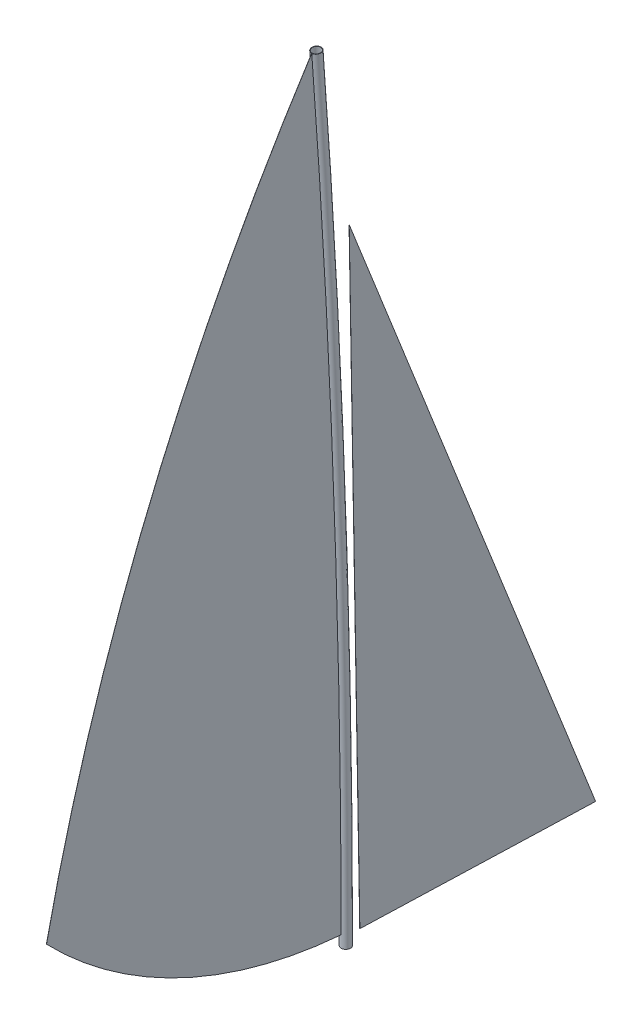
ISO-10303-21;
HEADER;
FILE_DESCRIPTION(('STEP AP214'),'2;1');
FILE_NAME('part.step','',(''),(''),'','','');
FILE_SCHEMA(('AUTOMOTIVE_DESIGN { 1 0 10303 214 1 1 1 1 }'));
ENDSEC;
DATA;
#1=APPLICATION_CONTEXT('core data for automotive mechanical design processes');
#2=APPLICATION_PROTOCOL_DEFINITION('international standard','automotive_design',2000,#1);
#3=PRODUCT_CONTEXT('',#1,'mechanical');
#4=PRODUCT('Part','Part','',(#3));
#5=PRODUCT_RELATED_PRODUCT_CATEGORY('part','',(#4));
#6=PRODUCT_DEFINITION_FORMATION('','',#4);
#7=PRODUCT_DEFINITION_CONTEXT('part definition',#1,'design');
#8=PRODUCT_DEFINITION('design','',#6,#7);
#9=PRODUCT_DEFINITION_SHAPE('','',#8);
#10=(LENGTH_UNIT() NAMED_UNIT(*) SI_UNIT(.MILLI.,.METRE.));
#11=(NAMED_UNIT(*) PLANE_ANGLE_UNIT() SI_UNIT($,.RADIAN.));
#12=(NAMED_UNIT(*) SI_UNIT($,.STERADIAN.) SOLID_ANGLE_UNIT());
#13=UNCERTAINTY_MEASURE_WITH_UNIT(LENGTH_MEASURE(1.E-05),#10,'distance_accuracy_value','');
#14=(GEOMETRIC_REPRESENTATION_CONTEXT(3) GLOBAL_UNCERTAINTY_ASSIGNED_CONTEXT((#13)) GLOBAL_UNIT_ASSIGNED_CONTEXT((#10,
#11,#12)) REPRESENTATION_CONTEXT('',''));
#15=CARTESIAN_POINT('',(0.,0.,0.));
#16=DIRECTION('',(0.,0.,1.));
#17=DIRECTION('',(1.,0.,0.));
#18=AXIS2_PLACEMENT_3D('',#15,#16,#17);
#19=CARTESIAN_POINT('',(1.,65.6200997669406,-117.637669057789));
#20=DIRECTION('',(0.,0.0173436040083489,-0.999849588388174));
#21=DIRECTION('',(0.,0.999849588388175,0.017343604008349));
#22=AXIS2_PLACEMENT_3D('',#19,#20,#21);
#23=PLANE('',#22);
#24=DIRECTION('',(0.,-0.999849588388174,-0.0173436040083489));
#25=VECTOR('',#24,1.);
#26=CARTESIAN_POINT('',(0.,65.6200997669406,-117.637669057789));
#27=LINE('',#26,#25);
#28=CARTESIAN_POINT('',(0.,5280.05370710479,-27.1869926122602));
#29=VERTEX_POINT('',#28);
#30=CARTESIAN_POINT('',(0.,65.6200997669406,-117.637669057789));
#31=VERTEX_POINT('',#30);
#32=EDGE_CURVE('E12',#29,#31,#27,.T.);
#33=ORIENTED_EDGE('',*,*,#32,.T.);
#34=DIRECTION('',(-1.,0.,0.));
#35=VECTOR('',#34,1.);
#36=CARTESIAN_POINT('',(1.,65.6200997669406,-117.637669057789));
#37=LINE('',#36,#35);
#38=CARTESIAN_POINT('',(1.,65.6200997669406,-117.637669057789));
#39=VERTEX_POINT('',#38);
#40=EDGE_CURVE('E142',#39,#31,#37,.T.);
#41=ORIENTED_EDGE('',*,*,#40,.F.);
#42=DIRECTION('',(0.,-0.999849588388174,-0.0173436040083489));
#43=VECTOR('',#42,1.);
#44=CARTESIAN_POINT('',(1.,65.6200997669406,-117.637669057789));
#45=LINE('',#44,#43);
#46=CARTESIAN_POINT('',(1.,5280.05370710479,-27.1869926122602));
#47=VERTEX_POINT('',#46);
#48=EDGE_CURVE('E56',#47,#39,#45,.T.);
#49=ORIENTED_EDGE('',*,*,#48,.F.);
#50=DIRECTION('',(-1.,0.,0.));
#51=VECTOR('',#50,1.);
#52=CARTESIAN_POINT('',(1.,5280.05370710479,-27.1869926122602));
#53=LINE('',#52,#51);
#54=EDGE_CURVE('E94',#47,#29,#53,.T.);
#55=ORIENTED_EDGE('',*,*,#54,.T.);
#56=EDGE_LOOP('',(#33,#41,#49,#55));
#57=FACE_BOUND('',#56,.T.);
#58=ADVANCED_FACE('F52',(#57),#23,.F.);
#59=CARTESIAN_POINT('',(1.,0.591107293252714,-2116.58019703048));
#60=DIRECTION('',(0.,0.999471263986346,-0.0325144962368439));
#61=DIRECTION('',(0.,0.0325144962368439,0.999471263986346));
#62=AXIS2_PLACEMENT_3D('',#59,#60,#61);
#63=PLANE('',#62);
#64=DIRECTION('',(0.,-0.0325144962368439,-0.999471263986346));
#65=VECTOR('',#64,1.);
#66=CARTESIAN_POINT('',(0.,0.591107293252714,-2116.58019703048));
#67=LINE('',#66,#65);
#68=CARTESIAN_POINT('',(0.,0.591107293252714,-2116.58019703048));
#69=VERTEX_POINT('',#68);
#70=EDGE_CURVE('E62',#31,#69,#67,.T.);
#71=ORIENTED_EDGE('',*,*,#70,.T.);
#72=DIRECTION('',(-1.,0.,0.));
#73=VECTOR('',#72,1.);
#74=CARTESIAN_POINT('',(1.,0.591107293252714,-2116.58019703048));
#75=LINE('',#74,#73);
#76=CARTESIAN_POINT('',(1.,0.591107293252714,-2116.58019703048));
#77=VERTEX_POINT('',#76);
#78=EDGE_CURVE('E96',#77,#69,#75,.T.);
#79=ORIENTED_EDGE('',*,*,#78,.F.);
#80=DIRECTION('',(0.,-0.0325144962368439,-0.999471263986346));
#81=VECTOR('',#80,1.);
#82=CARTESIAN_POINT('',(1.,0.591107293252714,-2116.58019703048));
#83=LINE('',#82,#81);
#84=EDGE_CURVE('E83',#39,#77,#83,.T.);
#85=ORIENTED_EDGE('',*,*,#84,.F.);
#86=ORIENTED_EDGE('',*,*,#40,.T.);
#87=EDGE_LOOP('',(#71,#79,#85,#86));
#88=FACE_BOUND('',#87,.T.);
#89=ADVANCED_FACE('F109',(#88),#63,.F.);
#90=CARTESIAN_POINT('',(1.,5280.05370710479,-27.1869926122602));
#91=DIRECTION('',(0.,-0.367988446574022,0.929830362586659));
#92=DIRECTION('',(0.,-0.929830362586659,-0.367988446574022));
#93=AXIS2_PLACEMENT_3D('',#90,#91,#92);
#94=PLANE('',#93);
#95=DIRECTION('',(0.,0.929830362586659,0.367988446574022));
#96=VECTOR('',#95,1.);
#97=CARTESIAN_POINT('',(0.,5280.05370710479,-27.1869926122602));
#98=LINE('',#97,#96);
#99=EDGE_CURVE('E90',#69,#29,#98,.T.);
#100=ORIENTED_EDGE('',*,*,#99,.T.);
#101=ORIENTED_EDGE('',*,*,#54,.F.);
#102=DIRECTION('',(0.,0.929830362586659,0.367988446574022));
#103=VECTOR('',#102,1.);
#104=CARTESIAN_POINT('',(1.,5280.05370710479,-27.1869926122602));
#105=LINE('',#104,#103);
#106=EDGE_CURVE('E100',#77,#47,#105,.T.);
#107=ORIENTED_EDGE('',*,*,#106,.F.);
#108=ORIENTED_EDGE('',*,*,#78,.T.);
#109=EDGE_LOOP('',(#100,#101,#107,#108));
#110=FACE_BOUND('',#109,.T.);
#111=ADVANCED_FACE('F92',(#110),#94,.F.);
#112=CARTESIAN_POINT('',(1.,0.,0.));
#113=DIRECTION('',(1.,0.,0.));
#114=DIRECTION('',(0.,0.,-1.));
#115=AXIS2_PLACEMENT_3D('',#112,#113,#114);
#116=PLANE('',#115);
#117=ORIENTED_EDGE('',*,*,#48,.T.);
#118=ORIENTED_EDGE('',*,*,#84,.T.);
#119=ORIENTED_EDGE('',*,*,#106,.T.);
#120=EDGE_LOOP('',(#117,#118,#119));
#121=FACE_BOUND('',#120,.T.);
#122=ADVANCED_FACE('F54',(#121),#116,.T.);
#123=CARTESIAN_POINT('',(0.,0.,0.));
#124=DIRECTION('',(1.,0.,0.));
#125=DIRECTION('',(0.,0.,-1.));
#126=AXIS2_PLACEMENT_3D('',#123,#124,#125);
#127=PLANE('',#126);
#128=ORIENTED_EDGE('',*,*,#32,.F.);
#129=ORIENTED_EDGE('',*,*,#99,.F.);
#130=ORIENTED_EDGE('',*,*,#70,.F.);
#131=EDGE_LOOP('',(#128,#129,#130));
#132=FACE_BOUND('',#131,.T.);
#133=ADVANCED_FACE('F102',(#132),#127,.F.);
#134=CLOSED_SHELL('',(#58,#89,#111,#122,#133));
#135=MANIFOLD_SOLID_BREP('B2',#134);
#136=CARTESIAN_POINT('',(1.,-2184.75043029189,-13453.4213463346));
#137=DIRECTION('',(-1.,0.,0.));
#138=DIRECTION('',(0.,0.,1.));
#139=AXIS2_PLACEMENT_3D('',#136,#137,#138);
#140=CYLINDRICAL_SURFACE('',#139,16363.5082592903);
#141=CARTESIAN_POINT('',(0.,-2184.75043029189,-13453.4213463346));
#142=DIRECTION('',(1.,0.,0.));
#143=DIRECTION('',(0.,0.,-1.));
#144=AXIS2_PLACEMENT_3D('',#141,#142,#143);
#145=CIRCLE('',#144,16363.5082592903);
#146=CARTESIAN_POINT('',(0.,6697.01907569101,289.888771481017));
#147=VERTEX_POINT('',#146);
#148=CARTESIAN_POINT('',(0.,1279.78140516633,2539.12134433711));
#149=VERTEX_POINT('',#148);
#150=EDGE_CURVE('E204',#147,#149,#145,.T.);
#151=ORIENTED_EDGE('',*,*,#150,.T.);
#152=DIRECTION('',(-1.,0.,0.));
#153=VECTOR('',#152,1.);
#154=CARTESIAN_POINT('',(1.,1279.78140516633,2539.12134433711));
#155=LINE('',#154,#153);
#156=CARTESIAN_POINT('',(1.,1279.78140516633,2539.12134433711));
#157=VERTEX_POINT('',#156);
#158=EDGE_CURVE('E50',#157,#149,#155,.T.);
#159=ORIENTED_EDGE('',*,*,#158,.F.);
#160=CARTESIAN_POINT('',(1.,-2184.75043029189,-13453.4213463346));
#161=DIRECTION('',(1.,0.,0.));
#162=DIRECTION('',(0.,0.,-1.));
#163=AXIS2_PLACEMENT_3D('',#160,#161,#162);
#164=CIRCLE('',#163,16363.5082592903);
#165=CARTESIAN_POINT('',(1.,6697.01907569101,289.888771481017));
#166=VERTEX_POINT('',#165);
#167=EDGE_CURVE('E197',#166,#157,#164,.T.);
#168=ORIENTED_EDGE('',*,*,#167,.F.);
#169=DIRECTION('',(-1.,0.,0.));
#170=VECTOR('',#169,1.);
#171=CARTESIAN_POINT('',(1.,6697.01907569101,289.888771481017));
#172=LINE('',#171,#170);
#173=EDGE_CURVE('E205',#166,#147,#172,.T.);
#174=ORIENTED_EDGE('',*,*,#173,.T.);
#175=EDGE_LOOP('',(#151,#159,#168,#174));
#176=FACE_BOUND('',#175,.T.);
#177=ADVANCED_FACE('F157',(#176),#140,.T.);
#178=CARTESIAN_POINT('',(1.,4000.32900045834,-273.232981353334));
#179=DIRECTION('',(-1.,0.,0.));
#180=DIRECTION('',(0.,0.,1.));
#181=AXIS2_PLACEMENT_3D('',#178,#179,#180);
#182=CYLINDRICAL_SURFACE('',#181,3912.89101196019);
#183=CARTESIAN_POINT('',(0.,4000.32900045834,-273.232981353334));
#184=DIRECTION('',(1.,0.,0.));
#185=DIRECTION('',(0.,0.,1.));
#186=AXIS2_PLACEMENT_3D('',#183,#184,#185);
#187=CIRCLE('',#186,3912.89101196019);
#188=CARTESIAN_POINT('',(0.,100.,40.0556390313085));
#189=VERTEX_POINT('',#188);
#190=EDGE_CURVE('E185',#149,#189,#187,.T.);
#191=ORIENTED_EDGE('',*,*,#190,.T.);
#192=DIRECTION('',(-1.,0.,0.));
#193=VECTOR('',#192,1.);
#194=CARTESIAN_POINT('',(1.,100.,40.0556390313085));
#195=LINE('',#194,#193);
#196=CARTESIAN_POINT('',(1.,100.,40.0556390313085));
#197=VERTEX_POINT('',#196);
#198=EDGE_CURVE('E165',#197,#189,#195,.T.);
#199=ORIENTED_EDGE('',*,*,#198,.F.);
#200=CARTESIAN_POINT('',(1.,4000.32900045834,-273.232981353334));
#201=DIRECTION('',(1.,0.,0.));
#202=DIRECTION('',(0.,0.,1.));
#203=AXIS2_PLACEMENT_3D('',#200,#201,#202);
#204=CIRCLE('',#203,3912.89101196019);
#205=EDGE_CURVE('E193',#157,#197,#204,.T.);
#206=ORIENTED_EDGE('',*,*,#205,.F.);
#207=ORIENTED_EDGE('',*,*,#158,.T.);
#208=EDGE_LOOP('',(#191,#199,#206,#207));
#209=FACE_BOUND('',#208,.T.);
#210=ADVANCED_FACE('F194',(#209),#182,.T.);
#211=CARTESIAN_POINT('',(1.,0.,89905.));
#212=DIRECTION('',(-1.,0.,0.));
#213=DIRECTION('',(0.,0.,1.));
#214=AXIS2_PLACEMENT_3D('',#211,#212,#213);
#215=CYLINDRICAL_SURFACE('',#214,89865.);
#216=CARTESIAN_POINT('',(0.,0.,89905.));
#217=DIRECTION('',(1.,0.,0.));
#218=DIRECTION('',(0.,0.,-1.));
#219=AXIS2_PLACEMENT_3D('',#216,#217,#218);
#220=CIRCLE('',#219,89865.);
#221=EDGE_CURVE('E190',#189,#147,#220,.T.);
#222=ORIENTED_EDGE('',*,*,#221,.T.);
#223=ORIENTED_EDGE('',*,*,#173,.F.);
#224=CARTESIAN_POINT('',(1.,0.,89905.));
#225=DIRECTION('',(1.,0.,0.));
#226=DIRECTION('',(0.,0.,-1.));
#227=AXIS2_PLACEMENT_3D('',#224,#225,#226);
#228=CIRCLE('',#227,89865.);
#229=EDGE_CURVE('E173',#197,#166,#228,.T.);
#230=ORIENTED_EDGE('',*,*,#229,.F.);
#231=ORIENTED_EDGE('',*,*,#198,.T.);
#232=EDGE_LOOP('',(#222,#223,#230,#231));
#233=FACE_BOUND('',#232,.T.);
#234=ADVANCED_FACE('F212',(#233),#215,.T.);
#235=CARTESIAN_POINT('',(1.,907.789285083223,-6863.32716384397));
#236=DIRECTION('',(1.,0.,0.));
#237=DIRECTION('',(0.,0.,-1.));
#238=AXIS2_PLACEMENT_3D('',#235,#236,#237);
#239=PLANE('',#238);
#240=ORIENTED_EDGE('',*,*,#167,.T.);
#241=ORIENTED_EDGE('',*,*,#205,.T.);
#242=ORIENTED_EDGE('',*,*,#229,.T.);
#243=EDGE_LOOP('',(#240,#241,#242));
#244=FACE_BOUND('',#243,.T.);
#245=ADVANCED_FACE('F200',(#244),#239,.T.);
#246=CARTESIAN_POINT('',(0.,907.789285083223,-6863.32716384397));
#247=DIRECTION('',(1.,0.,0.));
#248=DIRECTION('',(0.,0.,-1.));
#249=AXIS2_PLACEMENT_3D('',#246,#247,#248);
#250=PLANE('',#249);
#251=ORIENTED_EDGE('',*,*,#150,.F.);
#252=ORIENTED_EDGE('',*,*,#221,.F.);
#253=ORIENTED_EDGE('',*,*,#190,.F.);
#254=EDGE_LOOP('',(#251,#252,#253));
#255=FACE_BOUND('',#254,.T.);
#256=ADVANCED_FACE('F213',(#255),#250,.F.);
#257=CLOSED_SHELL('',(#177,#210,#234,#245,#256));
#258=MANIFOLD_SOLID_BREP('B6',#257);
#259=CARTESIAN_POINT('',(0.,0.,0.));
#260=DIRECTION('',(0.,1.,0.));
#261=DIRECTION('',(0.,0.,1.));
#262=AXIS2_PLACEMENT_3D('',#259,#260,#261);
#263=PLANE('',#262);
#264=CARTESIAN_POINT('',(0.,0.,0.));
#265=DIRECTION('',(0.,1.,0.));
#266=DIRECTION('',(0.,0.,1.));
#267=AXIS2_PLACEMENT_3D('',#264,#265,#266);
#268=CIRCLE('',#267,37.);
#269=CARTESIAN_POINT('',(0.,0.,-37.0000000000061));
#270=VERTEX_POINT('',#269);
#271=EDGE_CURVE('E268',#270,#270,#268,.T.);
#272=ORIENTED_EDGE('',*,*,#271,.T.);
#273=EDGE_LOOP('',(#272));
#274=FACE_BOUND('',#273,.T.);
#275=CARTESIAN_POINT('',(0.,0.,0.));
#276=DIRECTION('',(0.,1.,0.));
#277=DIRECTION('',(0.,0.,1.));
#278=AXIS2_PLACEMENT_3D('',#275,#276,#277);
#279=CIRCLE('',#278,40.);
#280=CARTESIAN_POINT('',(0.,0.,-40.0000000000063));
#281=VERTEX_POINT('',#280);
#282=EDGE_CURVE('E260',#281,#281,#279,.T.);
#283=ORIENTED_EDGE('',*,*,#282,.F.);
#284=EDGE_LOOP('',(#283));
#285=FACE_BOUND('',#284,.T.);
#286=ADVANCED_FACE('F254',(#274,#285),#263,.F.);
#287=CARTESIAN_POINT('',(0.,6700.,250.));
#288=DIRECTION('',(0.,0.997219287025193,0.0745231077248207));
#289=DIRECTION('',(0.,-0.0745231077248207,0.997219287025193));
#290=AXIS2_PLACEMENT_3D('',#287,#288,#289);
#291=PLANE('',#290);
#292=CARTESIAN_POINT('',(0.,6700.,250.));
#293=DIRECTION('',(0.,0.997219287025193,0.0745231077248207));
#294=DIRECTION('',(0.,-0.0745231077248207,0.997219287025193));
#295=AXIS2_PLACEMENT_3D('',#292,#293,#294);
#296=CIRCLE('',#295,37.);
#297=CARTESIAN_POINT('',(0.,6702.75735498582,213.102886380057));
#298=VERTEX_POINT('',#297);
#299=EDGE_CURVE('E264',#298,#298,#296,.T.);
#300=ORIENTED_EDGE('',*,*,#299,.F.);
#301=EDGE_LOOP('',(#300));
#302=FACE_BOUND('',#301,.T.);
#303=CARTESIAN_POINT('',(0.,6700.,250.));
#304=DIRECTION('',(0.,0.997219287025193,0.0745231077248207));
#305=DIRECTION('',(0.,-0.0745231077248207,0.997219287025193));
#306=AXIS2_PLACEMENT_3D('',#303,#304,#305);
#307=CIRCLE('',#306,40.);
#308=CARTESIAN_POINT('',(0.,6702.98092430899,210.111228518983));
#309=VERTEX_POINT('',#308);
#310=EDGE_CURVE('E156',#309,#309,#307,.T.);
#311=ORIENTED_EDGE('',*,*,#310,.T.);
#312=EDGE_LOOP('',(#311));
#313=FACE_BOUND('',#312,.T.);
#314=ADVANCED_FACE('F284',(#302,#313),#291,.T.);
#315=CARTESIAN_POINT('',(0.,0.,89905.));
#316=DIRECTION('',(1.,0.,0.));
#317=DIRECTION('',(0.,0.,-1.));
#318=AXIS2_PLACEMENT_3D('',#315,#316,#317);
#319=TOROIDAL_SURFACE('',#318,89905.,40.);
#320=CARTESIAN_POINT('',(0.,0.,89905.));
#321=DIRECTION('',(1.,0.,0.));
#322=DIRECTION('',(0.,0.,-1.));
#323=AXIS2_PLACEMENT_3D('',#320,#321,#322);
#324=CIRCLE('',#323,89945.);
#325=EDGE_CURVE('',#281,#309,#324,.T.);
#326=ORIENTED_EDGE('',*,*,#282,.T.);
#327=ORIENTED_EDGE('',*,*,#310,.F.);
#328=ORIENTED_EDGE('',*,*,#325,.T.);
#329=ORIENTED_EDGE('',*,*,#325,.F.);
#330=EDGE_LOOP('',(#326,#328,#327,#329));
#331=FACE_BOUND('',#330,.T.);
#332=ADVANCED_FACE('F278',(#331),#319,.T.);
#333=CARTESIAN_POINT('',(0.,0.,89905.));
#334=DIRECTION('',(1.,0.,0.));
#335=DIRECTION('',(0.,0.,-1.));
#336=AXIS2_PLACEMENT_3D('',#333,#334,#335);
#337=TOROIDAL_SURFACE('',#336,89905.,37.);
#338=CARTESIAN_POINT('',(0.,0.,89905.));
#339=DIRECTION('',(1.,0.,0.));
#340=DIRECTION('',(0.,0.,-1.));
#341=AXIS2_PLACEMENT_3D('',#338,#339,#340);
#342=CIRCLE('',#341,89942.);
#343=EDGE_CURVE('',#270,#298,#342,.T.);
#344=ORIENTED_EDGE('',*,*,#271,.F.);
#345=ORIENTED_EDGE('',*,*,#299,.T.);
#346=ORIENTED_EDGE('',*,*,#343,.T.);
#347=ORIENTED_EDGE('',*,*,#343,.F.);
#348=EDGE_LOOP('',(#344,#346,#345,#347));
#349=FACE_BOUND('',#348,.T.);
#350=ADVANCED_FACE('F276',(#349),#337,.F.);
#351=CLOSED_SHELL('',(#286,#314,#332,#350));
#352=MANIFOLD_SOLID_BREP('B44',#351);
#353=ADVANCED_BREP_SHAPE_REPRESENTATION('',(#18,#135,#258,#352),#14);
#354=SHAPE_DEFINITION_REPRESENTATION(#9,#353);
ENDSEC;
END-ISO-10303-21;
